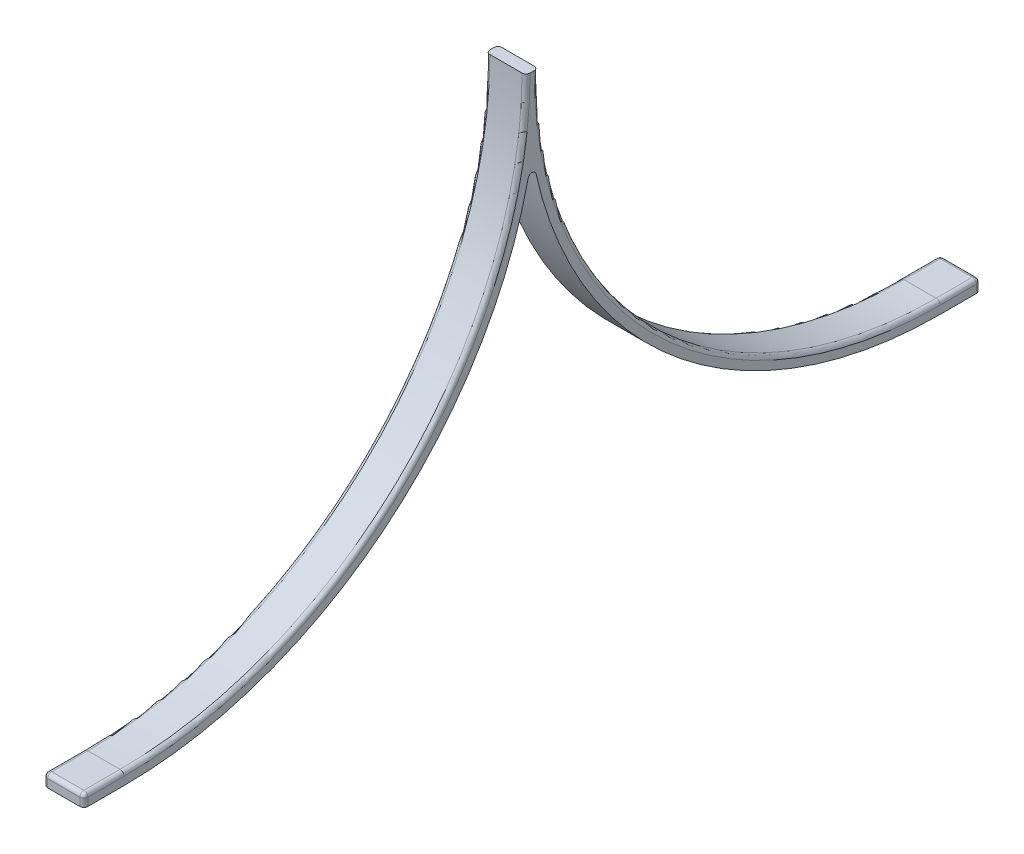
ISO-10303-21;
HEADER;
FILE_DESCRIPTION(('STEP AP214'),'2;1');
FILE_NAME('part.step','',(''),(''),'','','');
FILE_SCHEMA(('AUTOMOTIVE_DESIGN { 1 0 10303 214 1 1 1 1 }'));
ENDSEC;
DATA;
#1=APPLICATION_CONTEXT('core data for automotive mechanical design processes');
#2=APPLICATION_PROTOCOL_DEFINITION('international standard','automotive_design',2000,#1);
#3=PRODUCT_CONTEXT('',#1,'mechanical');
#4=PRODUCT('Part','Part','',(#3));
#5=PRODUCT_RELATED_PRODUCT_CATEGORY('part','',(#4));
#6=PRODUCT_DEFINITION_FORMATION('','',#4);
#7=PRODUCT_DEFINITION_CONTEXT('part definition',#1,'design');
#8=PRODUCT_DEFINITION('design','',#6,#7);
#9=PRODUCT_DEFINITION_SHAPE('','',#8);
#10=(LENGTH_UNIT() NAMED_UNIT(*) SI_UNIT(.MILLI.,.METRE.));
#11=(NAMED_UNIT(*) PLANE_ANGLE_UNIT() SI_UNIT($,.RADIAN.));
#12=(NAMED_UNIT(*) SI_UNIT($,.STERADIAN.) SOLID_ANGLE_UNIT());
#13=UNCERTAINTY_MEASURE_WITH_UNIT(LENGTH_MEASURE(1.E-05),#10,'distance_accuracy_value','');
#14=(GEOMETRIC_REPRESENTATION_CONTEXT(3) GLOBAL_UNCERTAINTY_ASSIGNED_CONTEXT((#13)) GLOBAL_UNIT_ASSIGNED_CONTEXT((#10,
#11,#12)) REPRESENTATION_CONTEXT('',''));
#15=CARTESIAN_POINT('',(0.,0.,0.));
#16=DIRECTION('',(0.,0.,1.));
#17=DIRECTION('',(1.,0.,0.));
#18=AXIS2_PLACEMENT_3D('',#15,#16,#17);
#19=CARTESIAN_POINT('',(75.,-318.5,62.9999999999999));
#20=DIRECTION('',(-1.,0.,0.));
#21=DIRECTION('',(0.,0.,1.));
#22=AXIS2_PLACEMENT_3D('',#19,#20,#21);
#23=CYLINDRICAL_SURFACE('',#22,100.);
#24=DIRECTION('',(-1.,0.,0.));
#25=VECTOR('',#24,1.);
#26=CARTESIAN_POINT('',(75.,-418.5,62.9999999999999));
#27=LINE('',#26,#25);
#28=CARTESIAN_POINT('',(74.,-418.5,62.9999999999999));
#29=VERTEX_POINT('',#28);
#30=CARTESIAN_POINT('',(66.,-418.5,62.9999999999999));
#31=VERTEX_POINT('',#30);
#32=EDGE_CURVE('E206',#29,#31,#27,.T.);
#33=ORIENTED_EDGE('',*,*,#32,.T.);
#34=CARTESIAN_POINT('',(66.,-318.5,62.9999999999999));
#35=DIRECTION('',(1.,0.,0.));
#36=DIRECTION('',(0.,1.,0.));
#37=AXIS2_PLACEMENT_3D('',#34,#35,#36);
#38=CIRCLE('',#37,100.);
#39=CARTESIAN_POINT('',(66.,-318.5,163.));
#40=VERTEX_POINT('',#39);
#41=EDGE_CURVE('E209',#31,#40,#38,.F.);
#42=ORIENTED_EDGE('',*,*,#41,.T.);
#43=DIRECTION('',(-1.,0.,0.));
#44=VECTOR('',#43,1.);
#45=CARTESIAN_POINT('',(75.,-318.5,163.));
#46=LINE('',#45,#44);
#47=CARTESIAN_POINT('',(74.,-318.5,163.));
#48=VERTEX_POINT('',#47);
#49=EDGE_CURVE('E199',#48,#40,#46,.T.);
#50=ORIENTED_EDGE('',*,*,#49,.F.);
#51=CARTESIAN_POINT('',(74.,-318.5,62.9999999999999));
#52=DIRECTION('',(-1.,0.,0.));
#53=DIRECTION('',(0.,0.,1.));
#54=AXIS2_PLACEMENT_3D('',#51,#52,#53);
#55=CIRCLE('',#54,100.);
#56=EDGE_CURVE('E291',#48,#29,#55,.F.);
#57=ORIENTED_EDGE('',*,*,#56,.T.);
#58=EDGE_LOOP('',(#33,#42,#50,#57));
#59=FACE_BOUND('',#58,.T.);
#60=ADVANCED_FACE('F64',(#59),#23,.F.);
#61=CARTESIAN_POINT('',(75.,-318.5,62.9999999999999));
#62=DIRECTION('',(-1.,0.,0.));
#63=DIRECTION('',(0.,0.,1.));
#64=AXIS2_PLACEMENT_3D('',#61,#62,#63);
#65=CYLINDRICAL_SURFACE('',#64,103.);
#66=CARTESIAN_POINT('',(75.,-318.5,62.9999999999999));
#67=DIRECTION('',(-1.,0.,0.));
#68=DIRECTION('',(0.,0.,-1.));
#69=AXIS2_PLACEMENT_3D('',#66,#67,#68);
#70=CIRCLE('',#69,103.);
#71=CARTESIAN_POINT('',(75.,-421.5,62.9999999999999));
#72=VERTEX_POINT('',#71);
#73=CARTESIAN_POINT('',(75.,-340.948111087197,163.524038461538));
#74=VERTEX_POINT('',#73);
#75=EDGE_CURVE('E290',#72,#74,#70,.T.);
#76=ORIENTED_EDGE('',*,*,#75,.T.);
#77=DIRECTION('',(-1.,0.,0.));
#78=VECTOR('',#77,1.);
#79=CARTESIAN_POINT('',(75.,-340.948111087197,163.524038461538));
#80=LINE('',#79,#78);
#81=CARTESIAN_POINT('',(65.,-340.948111087197,163.524038461538));
#82=VERTEX_POINT('',#81);
#83=EDGE_CURVE('E183',#74,#82,#80,.T.);
#84=ORIENTED_EDGE('',*,*,#83,.T.);
#85=CARTESIAN_POINT('',(65.,-318.5,62.9999999999999));
#86=DIRECTION('',(1.,0.,0.));
#87=DIRECTION('',(0.,1.,0.));
#88=AXIS2_PLACEMENT_3D('',#85,#86,#87);
#89=CIRCLE('',#88,103.);
#90=CARTESIAN_POINT('',(65.,-421.5,62.9999999999999));
#91=VERTEX_POINT('',#90);
#92=EDGE_CURVE('E167',#91,#82,#89,.F.);
#93=ORIENTED_EDGE('',*,*,#92,.F.);
#94=DIRECTION('',(-1.,0.,0.));
#95=VECTOR('',#94,1.);
#96=CARTESIAN_POINT('',(75.,-421.5,62.9999999999999));
#97=LINE('',#96,#95);
#98=EDGE_CURVE('E180',#72,#91,#97,.T.);
#99=ORIENTED_EDGE('',*,*,#98,.F.);
#100=EDGE_LOOP('',(#76,#84,#93,#99));
#101=FACE_BOUND('',#100,.T.);
#102=ADVANCED_FACE('F179',(#101),#65,.T.);
#103=CARTESIAN_POINT('',(75.,-421.5,52.9999999999999));
#104=DIRECTION('',(0.,-1.,0.));
#105=DIRECTION('',(0.,0.,-1.));
#106=AXIS2_PLACEMENT_3D('',#103,#104,#105);
#107=PLANE('',#106);
#108=DIRECTION('',(-1.,0.,0.));
#109=VECTOR('',#108,1.);
#110=CARTESIAN_POINT('',(75.,-421.5,52.9999999999999));
#111=LINE('',#110,#109);
#112=CARTESIAN_POINT('',(74.,-421.5,52.9999999999999));
#113=VERTEX_POINT('',#112);
#114=CARTESIAN_POINT('',(66.,-421.5,52.9999999999999));
#115=VERTEX_POINT('',#114);
#116=EDGE_CURVE('E201',#113,#115,#111,.T.);
#117=ORIENTED_EDGE('',*,*,#116,.F.);
#118=CARTESIAN_POINT('',(74.,-421.5,53.9999999999999));
#119=DIRECTION('',(0.,-1.,0.));
#120=DIRECTION('',(0.,0.,-1.));
#121=AXIS2_PLACEMENT_3D('',#118,#119,#120);
#122=CIRCLE('',#121,1.);
#123=CARTESIAN_POINT('',(75.,-421.5,53.9999999999999));
#124=VERTEX_POINT('',#123);
#125=EDGE_CURVE('E195',#113,#124,#122,.T.);
#126=ORIENTED_EDGE('',*,*,#125,.T.);
#127=DIRECTION('',(0.,0.,1.));
#128=VECTOR('',#127,1.);
#129=CARTESIAN_POINT('',(75.,-421.5,52.9999999999999));
#130=LINE('',#129,#128);
#131=EDGE_CURVE('E190',#124,#72,#130,.T.);
#132=ORIENTED_EDGE('',*,*,#131,.T.);
#133=ORIENTED_EDGE('',*,*,#98,.T.);
#134=DIRECTION('',(0.,0.,1.));
#135=VECTOR('',#134,1.);
#136=CARTESIAN_POINT('',(65.,-421.5,52.9999999999999));
#137=LINE('',#136,#135);
#138=CARTESIAN_POINT('',(65.,-421.5,53.9999999999999));
#139=VERTEX_POINT('',#138);
#140=EDGE_CURVE('E164',#139,#91,#137,.T.);
#141=ORIENTED_EDGE('',*,*,#140,.F.);
#142=CARTESIAN_POINT('',(66.,-421.5,53.9999999999999));
#143=DIRECTION('',(0.,-1.,0.));
#144=DIRECTION('',(0.,0.,-1.));
#145=AXIS2_PLACEMENT_3D('',#142,#143,#144);
#146=CIRCLE('',#145,1.);
#147=EDGE_CURVE('E191',#139,#115,#146,.T.);
#148=ORIENTED_EDGE('',*,*,#147,.T.);
#149=EDGE_LOOP('',(#117,#126,#132,#133,#141,#148));
#150=FACE_BOUND('',#149,.T.);
#151=ADVANCED_FACE('F187',(#150),#107,.T.);
#152=CARTESIAN_POINT('',(75.,-418.5,52.9999999999999));
#153=DIRECTION('',(0.,0.,-1.));
#154=DIRECTION('',(0.,1.,0.));
#155=AXIS2_PLACEMENT_3D('',#152,#153,#154);
#156=PLANE('',#155);
#157=DIRECTION('',(-1.,0.,0.));
#158=VECTOR('',#157,1.);
#159=CARTESIAN_POINT('',(75.,-419.5,52.9999999999999));
#160=LINE('',#159,#158);
#161=CARTESIAN_POINT('',(66.,-419.5,52.9999999999999));
#162=VERTEX_POINT('',#161);
#163=CARTESIAN_POINT('',(74.,-419.5,52.9999999999999));
#164=VERTEX_POINT('',#163);
#165=EDGE_CURVE('E193',#162,#164,#160,.F.);
#166=ORIENTED_EDGE('',*,*,#165,.T.);
#167=DIRECTION('',(0.,-1.,0.));
#168=VECTOR('',#167,1.);
#169=CARTESIAN_POINT('',(74.,-421.5,52.9999999999999));
#170=LINE('',#169,#168);
#171=EDGE_CURVE('E205',#164,#113,#170,.T.);
#172=ORIENTED_EDGE('',*,*,#171,.T.);
#173=ORIENTED_EDGE('',*,*,#116,.T.);
#174=DIRECTION('',(0.,-1.,0.));
#175=VECTOR('',#174,1.);
#176=CARTESIAN_POINT('',(66.,-418.5,52.9999999999999));
#177=LINE('',#176,#175);
#178=EDGE_CURVE('E204',#115,#162,#177,.F.);
#179=ORIENTED_EDGE('',*,*,#178,.T.);
#180=EDGE_LOOP('',(#166,#172,#173,#179));
#181=FACE_BOUND('',#180,.T.);
#182=ADVANCED_FACE('F416',(#181),#156,.T.);
#183=CARTESIAN_POINT('',(75.,-418.5,62.9999999999999));
#184=DIRECTION('',(0.,1.,0.));
#185=DIRECTION('',(0.,0.,1.));
#186=AXIS2_PLACEMENT_3D('',#183,#184,#185);
#187=PLANE('',#186);
#188=DIRECTION('',(-1.,0.,0.));
#189=VECTOR('',#188,1.);
#190=CARTESIAN_POINT('',(75.,-418.5,53.9999999999999));
#191=LINE('',#190,#189);
#192=CARTESIAN_POINT('',(74.,-418.5,53.9999999999999));
#193=VERTEX_POINT('',#192);
#194=CARTESIAN_POINT('',(66.,-418.5,53.9999999999999));
#195=VERTEX_POINT('',#194);
#196=EDGE_CURVE('E260',#193,#195,#191,.T.);
#197=ORIENTED_EDGE('',*,*,#196,.T.);
#198=DIRECTION('',(0.,0.,-1.));
#199=VECTOR('',#198,1.);
#200=CARTESIAN_POINT('',(66.,-418.5,62.9999999999999));
#201=LINE('',#200,#199);
#202=EDGE_CURVE('E256',#195,#31,#201,.F.);
#203=ORIENTED_EDGE('',*,*,#202,.T.);
#204=ORIENTED_EDGE('',*,*,#32,.F.);
#205=DIRECTION('',(0.,0.,-1.));
#206=VECTOR('',#205,1.);
#207=CARTESIAN_POINT('',(74.,-418.5,52.9999999999999));
#208=LINE('',#207,#206);
#209=EDGE_CURVE('E259',#29,#193,#208,.T.);
#210=ORIENTED_EDGE('',*,*,#209,.T.);
#211=EDGE_LOOP('',(#197,#203,#204,#210));
#212=FACE_BOUND('',#211,.T.);
#213=ADVANCED_FACE('F484',(#212),#187,.T.);
#214=CARTESIAN_POINT('',(75.,-318.5,266.));
#215=DIRECTION('',(-1.,0.,0.));
#216=DIRECTION('',(0.,0.,1.));
#217=AXIS2_PLACEMENT_3D('',#214,#215,#216);
#218=CYLINDRICAL_SURFACE('',#217,100.);
#219=DIRECTION('',(-1.,0.,0.));
#220=VECTOR('',#219,1.);
#221=CARTESIAN_POINT('',(75.,-318.5,166.));
#222=LINE('',#221,#220);
#223=CARTESIAN_POINT('',(74.,-318.5,166.));
#224=VERTEX_POINT('',#223);
#225=CARTESIAN_POINT('',(66.,-318.5,166.));
#226=VERTEX_POINT('',#225);
#227=EDGE_CURVE('E263',#224,#226,#222,.T.);
#228=ORIENTED_EDGE('',*,*,#227,.T.);
#229=CARTESIAN_POINT('',(66.,-318.5,266.));
#230=DIRECTION('',(1.,0.,0.));
#231=DIRECTION('',(0.,1.,0.));
#232=AXIS2_PLACEMENT_3D('',#229,#230,#231);
#233=CIRCLE('',#232,100.);
#234=CARTESIAN_POINT('',(66.,-418.5,266.));
#235=VERTEX_POINT('',#234);
#236=EDGE_CURVE('E266',#226,#235,#233,.F.);
#237=ORIENTED_EDGE('',*,*,#236,.T.);
#238=DIRECTION('',(-1.,0.,0.));
#239=VECTOR('',#238,1.);
#240=CARTESIAN_POINT('',(75.,-418.5,266.));
#241=LINE('',#240,#239);
#242=CARTESIAN_POINT('',(74.,-418.5,266.));
#243=VERTEX_POINT('',#242);
#244=EDGE_CURVE('E210',#243,#235,#241,.T.);
#245=ORIENTED_EDGE('',*,*,#244,.F.);
#246=CARTESIAN_POINT('',(74.,-318.5,266.));
#247=DIRECTION('',(-1.,0.,0.));
#248=DIRECTION('',(0.,0.,1.));
#249=AXIS2_PLACEMENT_3D('',#246,#247,#248);
#250=CIRCLE('',#249,100.);
#251=EDGE_CURVE('E213',#243,#224,#250,.F.);
#252=ORIENTED_EDGE('',*,*,#251,.T.);
#253=EDGE_LOOP('',(#228,#237,#245,#252));
#254=FACE_BOUND('',#253,.T.);
#255=ADVANCED_FACE('F304',(#254),#218,.F.);
#256=CARTESIAN_POINT('',(75.,-418.5,266.));
#257=DIRECTION('',(0.,-1.,0.));
#258=DIRECTION('',(0.,0.,-1.));
#259=AXIS2_PLACEMENT_3D('',#256,#257,#258);
#260=PLANE('',#259);
#261=ORIENTED_EDGE('',*,*,#244,.T.);
#262=DIRECTION('',(0.,0.,1.));
#263=VECTOR('',#262,1.);
#264=CARTESIAN_POINT('',(66.,-418.5,266.));
#265=LINE('',#264,#263);
#266=CARTESIAN_POINT('',(66.,-418.5,275.));
#267=VERTEX_POINT('',#266);
#268=EDGE_CURVE('E212',#235,#267,#265,.T.);
#269=ORIENTED_EDGE('',*,*,#268,.T.);
#270=DIRECTION('',(-1.,0.,0.));
#271=VECTOR('',#270,1.);
#272=CARTESIAN_POINT('',(75.,-418.5,275.));
#273=LINE('',#272,#271);
#274=CARTESIAN_POINT('',(74.,-418.5,275.));
#275=VERTEX_POINT('',#274);
#276=EDGE_CURVE('E281',#267,#275,#273,.F.);
#277=ORIENTED_EDGE('',*,*,#276,.T.);
#278=DIRECTION('',(0.,0.,1.));
#279=VECTOR('',#278,1.);
#280=CARTESIAN_POINT('',(74.,-418.5,266.));
#281=LINE('',#280,#279);
#282=EDGE_CURVE('E282',#275,#243,#281,.F.);
#283=ORIENTED_EDGE('',*,*,#282,.T.);
#284=EDGE_LOOP('',(#261,#269,#277,#283));
#285=FACE_BOUND('',#284,.T.);
#286=ADVANCED_FACE('F467',(#285),#260,.F.);
#287=CARTESIAN_POINT('',(75.,-418.5,276.));
#288=DIRECTION('',(0.,0.,-1.));
#289=DIRECTION('',(0.,1.,0.));
#290=AXIS2_PLACEMENT_3D('',#287,#288,#289);
#291=PLANE('',#290);
#292=DIRECTION('',(-1.,0.,0.));
#293=VECTOR('',#292,1.);
#294=CARTESIAN_POINT('',(75.,-421.5,276.));
#295=LINE('',#294,#293);
#296=CARTESIAN_POINT('',(74.,-421.5,276.));
#297=VERTEX_POINT('',#296);
#298=CARTESIAN_POINT('',(66.,-421.5,276.));
#299=VERTEX_POINT('',#298);
#300=EDGE_CURVE('E214',#297,#299,#295,.T.);
#301=ORIENTED_EDGE('',*,*,#300,.F.);
#302=DIRECTION('',(0.,-1.,0.));
#303=VECTOR('',#302,1.);
#304=CARTESIAN_POINT('',(74.,-418.5,276.));
#305=LINE('',#304,#303);
#306=CARTESIAN_POINT('',(74.,-419.5,276.));
#307=VERTEX_POINT('',#306);
#308=EDGE_CURVE('E284',#297,#307,#305,.F.);
#309=ORIENTED_EDGE('',*,*,#308,.T.);
#310=DIRECTION('',(-1.,0.,0.));
#311=VECTOR('',#310,1.);
#312=CARTESIAN_POINT('',(75.,-419.5,276.));
#313=LINE('',#312,#311);
#314=CARTESIAN_POINT('',(66.,-419.5,276.));
#315=VERTEX_POINT('',#314);
#316=EDGE_CURVE('E230',#307,#315,#313,.T.);
#317=ORIENTED_EDGE('',*,*,#316,.T.);
#318=DIRECTION('',(0.,1.,0.));
#319=VECTOR('',#318,1.);
#320=CARTESIAN_POINT('',(66.,-418.5,276.));
#321=LINE('',#320,#319);
#322=EDGE_CURVE('E225',#315,#299,#321,.F.);
#323=ORIENTED_EDGE('',*,*,#322,.T.);
#324=EDGE_LOOP('',(#301,#309,#317,#323));
#325=FACE_BOUND('',#324,.T.);
#326=ADVANCED_FACE('F350',(#325),#291,.F.);
#327=CARTESIAN_POINT('',(75.,-421.5,276.));
#328=DIRECTION('',(0.,1.,0.));
#329=DIRECTION('',(0.,0.,1.));
#330=AXIS2_PLACEMENT_3D('',#327,#328,#329);
#331=PLANE('',#330);
#332=DIRECTION('',(0.,0.,-1.));
#333=VECTOR('',#332,1.);
#334=CARTESIAN_POINT('',(75.,-421.5,276.));
#335=LINE('',#334,#333);
#336=CARTESIAN_POINT('',(75.,-421.5,275.));
#337=VERTEX_POINT('',#336);
#338=CARTESIAN_POINT('',(75.,-421.5,266.));
#339=VERTEX_POINT('',#338);
#340=EDGE_CURVE('E244',#337,#339,#335,.T.);
#341=ORIENTED_EDGE('',*,*,#340,.F.);
#342=CARTESIAN_POINT('',(74.,-421.5,275.));
#343=DIRECTION('',(0.,1.,0.));
#344=DIRECTION('',(0.,0.,1.));
#345=AXIS2_PLACEMENT_3D('',#342,#343,#344);
#346=CIRCLE('',#345,1.);
#347=EDGE_CURVE('E217',#337,#297,#346,.F.);
#348=ORIENTED_EDGE('',*,*,#347,.T.);
#349=ORIENTED_EDGE('',*,*,#300,.T.);
#350=CARTESIAN_POINT('',(66.,-421.5,275.));
#351=DIRECTION('',(0.,1.,0.));
#352=DIRECTION('',(0.,0.,1.));
#353=AXIS2_PLACEMENT_3D('',#350,#351,#352);
#354=CIRCLE('',#353,1.);
#355=CARTESIAN_POINT('',(65.,-421.5,275.));
#356=VERTEX_POINT('',#355);
#357=EDGE_CURVE('E216',#299,#356,#354,.F.);
#358=ORIENTED_EDGE('',*,*,#357,.T.);
#359=DIRECTION('',(0.,0.,-1.));
#360=VECTOR('',#359,1.);
#361=CARTESIAN_POINT('',(65.,-421.5,276.));
#362=LINE('',#361,#360);
#363=CARTESIAN_POINT('',(65.,-421.5,266.));
#364=VERTEX_POINT('',#363);
#365=EDGE_CURVE('E223',#356,#364,#362,.T.);
#366=ORIENTED_EDGE('',*,*,#365,.T.);
#367=DIRECTION('',(-1.,0.,0.));
#368=VECTOR('',#367,1.);
#369=CARTESIAN_POINT('',(75.,-421.5,266.));
#370=LINE('',#369,#368);
#371=EDGE_CURVE('E68',#339,#364,#370,.T.);
#372=ORIENTED_EDGE('',*,*,#371,.F.);
#373=EDGE_LOOP('',(#341,#348,#349,#358,#366,#372));
#374=FACE_BOUND('',#373,.T.);
#375=ADVANCED_FACE('F501',(#374),#331,.F.);
#376=CARTESIAN_POINT('',(75.,-318.5,266.));
#377=DIRECTION('',(-1.,0.,0.));
#378=DIRECTION('',(0.,0.,1.));
#379=AXIS2_PLACEMENT_3D('',#376,#377,#378);
#380=CYLINDRICAL_SURFACE('',#379,103.);
#381=CARTESIAN_POINT('',(65.,-318.5,266.));
#382=DIRECTION('',(1.,0.,0.));
#383=DIRECTION('',(0.,1.,0.));
#384=AXIS2_PLACEMENT_3D('',#381,#382,#383);
#385=CIRCLE('',#384,103.);
#386=CARTESIAN_POINT('',(65.,-340.948111087197,165.475961538461));
#387=VERTEX_POINT('',#386);
#388=EDGE_CURVE('E286',#364,#387,#385,.T.);
#389=ORIENTED_EDGE('',*,*,#388,.T.);
#390=DIRECTION('',(-1.,0.,0.));
#391=VECTOR('',#390,1.);
#392=CARTESIAN_POINT('',(75.,-340.948111087197,165.475961538461));
#393=LINE('',#392,#391);
#394=CARTESIAN_POINT('',(75.,-340.948111087197,165.475961538461));
#395=VERTEX_POINT('',#394);
#396=EDGE_CURVE('E289',#387,#395,#393,.F.);
#397=ORIENTED_EDGE('',*,*,#396,.T.);
#398=CARTESIAN_POINT('',(75.,-318.5,266.));
#399=DIRECTION('',(1.,0.,0.));
#400=DIRECTION('',(0.,0.,1.));
#401=AXIS2_PLACEMENT_3D('',#398,#399,#400);
#402=CIRCLE('',#401,103.);
#403=EDGE_CURVE('E294',#339,#395,#402,.T.);
#404=ORIENTED_EDGE('',*,*,#403,.F.);
#405=ORIENTED_EDGE('',*,*,#371,.T.);
#406=EDGE_LOOP('',(#389,#397,#404,#405));
#407=FACE_BOUND('',#406,.T.);
#408=ADVANCED_FACE('F498',(#407),#380,.T.);
#409=CARTESIAN_POINT('',(75.,0.,0.));
#410=DIRECTION('',(-1.,0.,0.));
#411=DIRECTION('',(0.,0.,1.));
#412=AXIS2_PLACEMENT_3D('',#409,#410,#411);
#413=PLANE('',#412);
#414=CARTESIAN_POINT('',(75.,-318.5,62.9999999999999));
#415=DIRECTION('',(-1.,0.,0.));
#416=DIRECTION('',(0.,0.,1.));
#417=AXIS2_PLACEMENT_3D('',#414,#415,#416);
#418=CIRCLE('',#417,101.);
#419=CARTESIAN_POINT('',(75.,-419.5,62.9999999999999));
#420=VERTEX_POINT('',#419);
#421=CARTESIAN_POINT('',(75.,-318.5,164.));
#422=VERTEX_POINT('',#421);
#423=EDGE_CURVE('E253',#420,#422,#418,.T.);
#424=ORIENTED_EDGE('',*,*,#423,.T.);
#425=DIRECTION('',(0.,0.,1.));
#426=VECTOR('',#425,1.);
#427=CARTESIAN_POINT('',(75.,-318.5,0.));
#428=LINE('',#427,#426);
#429=CARTESIAN_POINT('',(75.,-318.5,165.));
#430=VERTEX_POINT('',#429);
#431=EDGE_CURVE('E238',#422,#430,#428,.T.);
#432=ORIENTED_EDGE('',*,*,#431,.T.);
#433=CARTESIAN_POINT('',(75.,-318.5,266.));
#434=DIRECTION('',(-1.,0.,0.));
#435=DIRECTION('',(0.,0.,1.));
#436=AXIS2_PLACEMENT_3D('',#433,#434,#435);
#437=CIRCLE('',#436,101.);
#438=CARTESIAN_POINT('',(75.,-419.5,266.));
#439=VERTEX_POINT('',#438);
#440=EDGE_CURVE('E234',#430,#439,#437,.T.);
#441=ORIENTED_EDGE('',*,*,#440,.T.);
#442=DIRECTION('',(0.,0.,1.));
#443=VECTOR('',#442,1.);
#444=CARTESIAN_POINT('',(75.,-419.5,0.));
#445=LINE('',#444,#443);
#446=CARTESIAN_POINT('',(75.,-419.5,275.));
#447=VERTEX_POINT('',#446);
#448=EDGE_CURVE('E237',#439,#447,#445,.T.);
#449=ORIENTED_EDGE('',*,*,#448,.T.);
#450=DIRECTION('',(0.,-1.,0.));
#451=VECTOR('',#450,1.);
#452=CARTESIAN_POINT('',(75.,6.36065274524826E-13,274.999999999999));
#453=LINE('',#452,#451);
#454=EDGE_CURVE('E241',#447,#337,#453,.T.);
#455=ORIENTED_EDGE('',*,*,#454,.T.);
#456=ORIENTED_EDGE('',*,*,#340,.T.);
#457=ORIENTED_EDGE('',*,*,#403,.T.);
#458=CARTESIAN_POINT('',(75.,-341.166053913286,164.5));
#459=DIRECTION('',(-1.,0.,0.));
#460=DIRECTION('',(0.,0.,1.));
#461=AXIS2_PLACEMENT_3D('',#458,#459,#460);
#462=CIRCLE('',#461,1.);
#463=EDGE_CURVE('E249',#395,#74,#462,.T.);
#464=ORIENTED_EDGE('',*,*,#463,.T.);
#465=ORIENTED_EDGE('',*,*,#75,.F.);
#466=ORIENTED_EDGE('',*,*,#131,.F.);
#467=DIRECTION('',(0.,-1.,0.));
#468=VECTOR('',#467,1.);
#469=CARTESIAN_POINT('',(75.,-418.5,53.9999999999999));
#470=LINE('',#469,#468);
#471=CARTESIAN_POINT('',(75.,-419.5,53.9999999999999));
#472=VERTEX_POINT('',#471);
#473=EDGE_CURVE('E245',#124,#472,#470,.F.);
#474=ORIENTED_EDGE('',*,*,#473,.T.);
#475=DIRECTION('',(0.,0.,-1.));
#476=VECTOR('',#475,1.);
#477=CARTESIAN_POINT('',(75.,-419.5,62.9999999999999));
#478=LINE('',#477,#476);
#479=EDGE_CURVE('E248',#472,#420,#478,.F.);
#480=ORIENTED_EDGE('',*,*,#479,.T.);
#481=EDGE_LOOP('',(#424,#432,#441,#449,#455,#456,#457,#464,#465,#466,#474,#480));
#482=FACE_BOUND('',#481,.T.);
#483=ADVANCED_FACE('F489',(#482),#413,.F.);
#484=CARTESIAN_POINT('',(65.,-150.,-1.2E-05));
#485=DIRECTION('',(1.,0.,0.));
#486=DIRECTION('',(0.,1.,0.));
#487=AXIS2_PLACEMENT_3D('',#484,#485,#486);
#488=PLANE('',#487);
#489=CARTESIAN_POINT('',(65.,-318.5,266.));
#490=DIRECTION('',(1.,0.,0.));
#491=DIRECTION('',(0.,1.,0.));
#492=AXIS2_PLACEMENT_3D('',#489,#490,#491);
#493=CIRCLE('',#492,101.);
#494=CARTESIAN_POINT('',(65.,-419.5,266.));
#495=VERTEX_POINT('',#494);
#496=CARTESIAN_POINT('',(65.,-318.5,165.));
#497=VERTEX_POINT('',#496);
#498=EDGE_CURVE('E252',#495,#497,#493,.T.);
#499=ORIENTED_EDGE('',*,*,#498,.T.);
#500=DIRECTION('',(0.,0.,-1.));
#501=VECTOR('',#500,1.);
#502=CARTESIAN_POINT('',(65.,-318.5,-1.2E-05));
#503=LINE('',#502,#501);
#504=CARTESIAN_POINT('',(65.,-318.5,164.));
#505=VERTEX_POINT('',#504);
#506=EDGE_CURVE('E105',#497,#505,#503,.T.);
#507=ORIENTED_EDGE('',*,*,#506,.T.);
#508=CARTESIAN_POINT('',(65.,-318.5,62.9999999999999));
#509=DIRECTION('',(1.,0.,0.));
#510=DIRECTION('',(0.,1.,0.));
#511=AXIS2_PLACEMENT_3D('',#508,#509,#510);
#512=CIRCLE('',#511,101.);
#513=CARTESIAN_POINT('',(65.,-419.5,62.9999999999999));
#514=VERTEX_POINT('',#513);
#515=EDGE_CURVE('E278',#505,#514,#512,.T.);
#516=ORIENTED_EDGE('',*,*,#515,.T.);
#517=DIRECTION('',(0.,0.,-1.));
#518=VECTOR('',#517,1.);
#519=CARTESIAN_POINT('',(65.,-419.5,52.9999999999999));
#520=LINE('',#519,#518);
#521=CARTESIAN_POINT('',(65.,-419.5,53.9999999999999));
#522=VERTEX_POINT('',#521);
#523=EDGE_CURVE('E276',#514,#522,#520,.T.);
#524=ORIENTED_EDGE('',*,*,#523,.T.);
#525=DIRECTION('',(0.,-1.,0.));
#526=VECTOR('',#525,1.);
#527=CARTESIAN_POINT('',(65.,-421.5,53.9999999999999));
#528=LINE('',#527,#526);
#529=EDGE_CURVE('E169',#522,#139,#528,.T.);
#530=ORIENTED_EDGE('',*,*,#529,.T.);
#531=ORIENTED_EDGE('',*,*,#140,.T.);
#532=ORIENTED_EDGE('',*,*,#92,.T.);
#533=CARTESIAN_POINT('',(65.,-341.166053913286,164.5));
#534=DIRECTION('',(1.,0.,0.));
#535=DIRECTION('',(0.,1.,0.));
#536=AXIS2_PLACEMENT_3D('',#533,#534,#535);
#537=CIRCLE('',#536,1.);
#538=EDGE_CURVE('E184',#82,#387,#537,.T.);
#539=ORIENTED_EDGE('',*,*,#538,.T.);
#540=ORIENTED_EDGE('',*,*,#388,.F.);
#541=ORIENTED_EDGE('',*,*,#365,.F.);
#542=DIRECTION('',(0.,1.,0.));
#543=VECTOR('',#542,1.);
#544=CARTESIAN_POINT('',(65.,-149.999999999999,274.999999999999));
#545=LINE('',#544,#543);
#546=CARTESIAN_POINT('',(65.,-419.5,275.));
#547=VERTEX_POINT('',#546);
#548=EDGE_CURVE('E273',#356,#547,#545,.T.);
#549=ORIENTED_EDGE('',*,*,#548,.T.);
#550=DIRECTION('',(0.,0.,1.));
#551=VECTOR('',#550,1.);
#552=CARTESIAN_POINT('',(65.,-419.5,-1.2E-05));
#553=LINE('',#552,#551);
#554=EDGE_CURVE('E271',#547,#495,#553,.F.);
#555=ORIENTED_EDGE('',*,*,#554,.T.);
#556=EDGE_LOOP('',(#499,#507,#516,#524,#530,#531,#532,#539,#540,#541,#549,#555));
#557=FACE_BOUND('',#556,.T.);
#558=ADVANCED_FACE('F166',(#557),#488,.F.);
#559=CARTESIAN_POINT('',(74.,-318.5,62.9999999999999));
#560=DIRECTION('',(-1.,0.,0.));
#561=DIRECTION('',(0.,0.,1.));
#562=AXIS2_PLACEMENT_3D('',#559,#560,#561);
#563=TOROIDAL_SURFACE('',#562,101.,1.);
#564=CARTESIAN_POINT('',(74.,-318.5,164.));
#565=DIRECTION('',(0.,-1.,0.));
#566=DIRECTION('',(0.,0.,-1.));
#567=AXIS2_PLACEMENT_3D('',#564,#565,#566);
#568=CIRCLE('',#567,1.);
#569=EDGE_CURVE('E83',#48,#422,#568,.T.);
#570=ORIENTED_EDGE('',*,*,#569,.T.);
#571=ORIENTED_EDGE('',*,*,#423,.F.);
#572=CARTESIAN_POINT('',(74.,-419.5,62.9999999999999));
#573=DIRECTION('',(0.,0.,-1.));
#574=DIRECTION('',(-1.,0.,0.));
#575=AXIS2_PLACEMENT_3D('',#572,#573,#574);
#576=CIRCLE('',#575,1.);
#577=EDGE_CURVE('E472',#29,#420,#576,.T.);
#578=ORIENTED_EDGE('',*,*,#577,.F.);
#579=ORIENTED_EDGE('',*,*,#56,.F.);
#580=EDGE_LOOP('',(#570,#571,#578,#579));
#581=FACE_BOUND('',#580,.T.);
#582=ADVANCED_FACE('F480',(#581),#563,.T.);
#583=CARTESIAN_POINT('',(74.,-418.5,53.9999999999999));
#584=DIRECTION('',(0.,1.,0.));
#585=DIRECTION('',(0.,0.,1.));
#586=AXIS2_PLACEMENT_3D('',#583,#584,#585);
#587=CYLINDRICAL_SURFACE('',#586,1.);
#588=ORIENTED_EDGE('',*,*,#125,.F.);
#589=ORIENTED_EDGE('',*,*,#171,.F.);
#590=CARTESIAN_POINT('',(74.,-419.5,53.9999999999999));
#591=DIRECTION('',(0.,1.,0.));
#592=DIRECTION('',(0.,0.,1.));
#593=AXIS2_PLACEMENT_3D('',#590,#591,#592);
#594=CIRCLE('',#593,1.);
#595=EDGE_CURVE('E428',#472,#164,#594,.T.);
#596=ORIENTED_EDGE('',*,*,#595,.F.);
#597=ORIENTED_EDGE('',*,*,#473,.F.);
#598=EDGE_LOOP('',(#588,#589,#596,#597));
#599=FACE_BOUND('',#598,.T.);
#600=ADVANCED_FACE('F426',(#599),#587,.T.);
#601=CARTESIAN_POINT('',(74.,-419.5,62.9999999999999));
#602=DIRECTION('',(0.,0.,1.));
#603=DIRECTION('',(1.,0.,0.));
#604=AXIS2_PLACEMENT_3D('',#601,#602,#603);
#605=CYLINDRICAL_SURFACE('',#604,1.);
#606=ORIENTED_EDGE('',*,*,#577,.T.);
#607=ORIENTED_EDGE('',*,*,#479,.F.);
#608=CARTESIAN_POINT('',(74.,-419.5,53.9999999999999));
#609=DIRECTION('',(0.,0.,-1.));
#610=DIRECTION('',(-1.,0.,0.));
#611=AXIS2_PLACEMENT_3D('',#608,#609,#610);
#612=CIRCLE('',#611,1.);
#613=EDGE_CURVE('E436',#193,#472,#612,.T.);
#614=ORIENTED_EDGE('',*,*,#613,.F.);
#615=ORIENTED_EDGE('',*,*,#209,.F.);
#616=EDGE_LOOP('',(#606,#607,#614,#615));
#617=FACE_BOUND('',#616,.T.);
#618=ADVANCED_FACE('F487',(#617),#605,.T.);
#619=CARTESIAN_POINT('',(74.,-318.5,266.));
#620=DIRECTION('',(-1.,0.,0.));
#621=DIRECTION('',(0.,0.,1.));
#622=AXIS2_PLACEMENT_3D('',#619,#620,#621);
#623=TOROIDAL_SURFACE('',#622,101.,1.);
#624=CARTESIAN_POINT('',(74.,-318.5,165.));
#625=DIRECTION('',(0.,-1.,0.));
#626=DIRECTION('',(0.,0.,-1.));
#627=AXIS2_PLACEMENT_3D('',#624,#625,#626);
#628=CIRCLE('',#627,1.);
#629=EDGE_CURVE('E471',#430,#224,#628,.T.);
#630=ORIENTED_EDGE('',*,*,#629,.T.);
#631=ORIENTED_EDGE('',*,*,#251,.F.);
#632=CARTESIAN_POINT('',(74.,-419.5,266.));
#633=DIRECTION('',(0.,0.,1.));
#634=DIRECTION('',(1.,0.,0.));
#635=AXIS2_PLACEMENT_3D('',#632,#633,#634);
#636=CIRCLE('',#635,1.);
#637=EDGE_CURVE('E437',#439,#243,#636,.T.);
#638=ORIENTED_EDGE('',*,*,#637,.F.);
#639=ORIENTED_EDGE('',*,*,#440,.F.);
#640=EDGE_LOOP('',(#630,#631,#638,#639));
#641=FACE_BOUND('',#640,.T.);
#642=ADVANCED_FACE('F469',(#641),#623,.T.);
#643=CARTESIAN_POINT('',(74.,-419.5,53.9999999999999));
#644=DIRECTION('',(0.,0.,1.));
#645=DIRECTION('',(1.,0.,0.));
#646=AXIS2_PLACEMENT_3D('',#643,#644,#645);
#647=SPHERICAL_SURFACE('',#646,1.);
#648=ORIENTED_EDGE('',*,*,#613,.T.);
#649=ORIENTED_EDGE('',*,*,#595,.T.);
#650=CARTESIAN_POINT('',(74.,-419.5,53.9999999999999));
#651=DIRECTION('',(1.,0.,0.));
#652=DIRECTION('',(0.,0.,-1.));
#653=AXIS2_PLACEMENT_3D('',#650,#651,#652);
#654=CIRCLE('',#653,1.);
#655=EDGE_CURVE('E433',#193,#164,#654,.F.);
#656=ORIENTED_EDGE('',*,*,#655,.F.);
#657=EDGE_LOOP('',(#648,#649,#656));
#658=FACE_BOUND('',#657,.T.);
#659=ADVANCED_FACE('F432',(#658),#647,.T.);
#660=CARTESIAN_POINT('',(74.,-419.5,0.));
#661=DIRECTION('',(0.,0.,1.));
#662=DIRECTION('',(1.,0.,0.));
#663=AXIS2_PLACEMENT_3D('',#660,#661,#662);
#664=CYLINDRICAL_SURFACE('',#663,1.);
#665=ORIENTED_EDGE('',*,*,#637,.T.);
#666=ORIENTED_EDGE('',*,*,#282,.F.);
#667=CARTESIAN_POINT('',(74.,-419.5,275.));
#668=DIRECTION('',(0.,0.,1.));
#669=DIRECTION('',(0.,-1.,0.));
#670=AXIS2_PLACEMENT_3D('',#667,#668,#669);
#671=CIRCLE('',#670,1.);
#672=EDGE_CURVE('E443',#447,#275,#671,.T.);
#673=ORIENTED_EDGE('',*,*,#672,.F.);
#674=ORIENTED_EDGE('',*,*,#448,.F.);
#675=EDGE_LOOP('',(#665,#666,#673,#674));
#676=FACE_BOUND('',#675,.T.);
#677=ADVANCED_FACE('F464',(#676),#664,.T.);
#678=CARTESIAN_POINT('',(74.,6.36065274524826E-13,274.999999999999));
#679=DIRECTION('',(0.,-1.,0.));
#680=DIRECTION('',(0.,0.,-1.));
#681=AXIS2_PLACEMENT_3D('',#678,#679,#680);
#682=CYLINDRICAL_SURFACE('',#681,1.);
#683=ORIENTED_EDGE('',*,*,#347,.F.);
#684=ORIENTED_EDGE('',*,*,#454,.F.);
#685=CARTESIAN_POINT('',(74.,-419.5,275.));
#686=DIRECTION('',(0.,1.,0.));
#687=DIRECTION('',(0.,0.,1.));
#688=AXIS2_PLACEMENT_3D('',#685,#686,#687);
#689=CIRCLE('',#688,1.);
#690=EDGE_CURVE('E440',#307,#447,#689,.T.);
#691=ORIENTED_EDGE('',*,*,#690,.F.);
#692=ORIENTED_EDGE('',*,*,#308,.F.);
#693=EDGE_LOOP('',(#683,#684,#691,#692));
#694=FACE_BOUND('',#693,.T.);
#695=ADVANCED_FACE('F580',(#694),#682,.T.);
#696=CARTESIAN_POINT('',(66.,-150.,54.0000000000005));
#697=DIRECTION('',(0.,1.,0.));
#698=DIRECTION('',(0.,0.,1.));
#699=AXIS2_PLACEMENT_3D('',#696,#697,#698);
#700=CYLINDRICAL_SURFACE('',#699,1.);
#701=ORIENTED_EDGE('',*,*,#147,.F.);
#702=ORIENTED_EDGE('',*,*,#529,.F.);
#703=CARTESIAN_POINT('',(66.,-419.5,53.9999999999999));
#704=DIRECTION('',(0.,1.,0.));
#705=DIRECTION('',(0.,0.,1.));
#706=AXIS2_PLACEMENT_3D('',#703,#704,#705);
#707=CIRCLE('',#706,1.);
#708=EDGE_CURVE('E452',#162,#522,#707,.T.);
#709=ORIENTED_EDGE('',*,*,#708,.F.);
#710=ORIENTED_EDGE('',*,*,#178,.F.);
#711=EDGE_LOOP('',(#701,#702,#709,#710));
#712=FACE_BOUND('',#711,.T.);
#713=ADVANCED_FACE('F587',(#712),#700,.T.);
#714=CARTESIAN_POINT('',(75.,-419.5,53.9999999999999));
#715=DIRECTION('',(-1.,0.,0.));
#716=DIRECTION('',(0.,0.,1.));
#717=AXIS2_PLACEMENT_3D('',#714,#715,#716);
#718=CYLINDRICAL_SURFACE('',#717,1.);
#719=ORIENTED_EDGE('',*,*,#655,.T.);
#720=ORIENTED_EDGE('',*,*,#165,.F.);
#721=CARTESIAN_POINT('',(66.,-419.5,53.9999999999999));
#722=DIRECTION('',(-1.,0.,0.));
#723=DIRECTION('',(0.,0.,1.));
#724=AXIS2_PLACEMENT_3D('',#721,#722,#723);
#725=CIRCLE('',#724,1.);
#726=EDGE_CURVE('E450',#195,#162,#725,.T.);
#727=ORIENTED_EDGE('',*,*,#726,.F.);
#728=ORIENTED_EDGE('',*,*,#196,.F.);
#729=EDGE_LOOP('',(#719,#720,#727,#728));
#730=FACE_BOUND('',#729,.T.);
#731=ADVANCED_FACE('F439',(#730),#718,.T.);
#732=CARTESIAN_POINT('',(74.,-419.5,275.));
#733=DIRECTION('',(0.,0.,1.));
#734=DIRECTION('',(1.,0.,0.));
#735=AXIS2_PLACEMENT_3D('',#732,#733,#734);
#736=SPHERICAL_SURFACE('',#735,1.);
#737=ORIENTED_EDGE('',*,*,#690,.T.);
#738=ORIENTED_EDGE('',*,*,#672,.T.);
#739=CARTESIAN_POINT('',(74.,-419.5,275.));
#740=DIRECTION('',(1.,0.,0.));
#741=DIRECTION('',(0.,0.,-1.));
#742=AXIS2_PLACEMENT_3D('',#739,#740,#741);
#743=CIRCLE('',#742,1.);
#744=EDGE_CURVE('E372',#307,#275,#743,.F.);
#745=ORIENTED_EDGE('',*,*,#744,.F.);
#746=EDGE_LOOP('',(#737,#738,#745));
#747=FACE_BOUND('',#746,.T.);
#748=ADVANCED_FACE('F459',(#747),#736,.T.);
#749=CARTESIAN_POINT('',(66.,-419.5,53.9999999999999));
#750=DIRECTION('',(0.,0.,1.));
#751=DIRECTION('',(1.,0.,0.));
#752=AXIS2_PLACEMENT_3D('',#749,#750,#751);
#753=SPHERICAL_SURFACE('',#752,1.);
#754=ORIENTED_EDGE('',*,*,#726,.T.);
#755=ORIENTED_EDGE('',*,*,#708,.T.);
#756=CARTESIAN_POINT('',(66.,-419.5,53.9999999999999));
#757=DIRECTION('',(0.,0.,-1.));
#758=DIRECTION('',(-1.,0.,0.));
#759=AXIS2_PLACEMENT_3D('',#756,#757,#758);
#760=CIRCLE('',#759,1.);
#761=EDGE_CURVE('E369',#195,#522,#760,.F.);
#762=ORIENTED_EDGE('',*,*,#761,.F.);
#763=EDGE_LOOP('',(#754,#755,#762));
#764=FACE_BOUND('',#763,.T.);
#765=ADVANCED_FACE('F608',(#764),#753,.T.);
#766=CARTESIAN_POINT('',(75.,-419.5,275.));
#767=DIRECTION('',(-1.,0.,0.));
#768=DIRECTION('',(0.,0.,1.));
#769=AXIS2_PLACEMENT_3D('',#766,#767,#768);
#770=CYLINDRICAL_SURFACE('',#769,1.);
#771=ORIENTED_EDGE('',*,*,#744,.T.);
#772=ORIENTED_EDGE('',*,*,#276,.F.);
#773=CARTESIAN_POINT('',(66.,-419.5,275.));
#774=DIRECTION('',(-1.,0.,0.));
#775=DIRECTION('',(0.,0.,1.));
#776=AXIS2_PLACEMENT_3D('',#773,#774,#775);
#777=CIRCLE('',#776,1.);
#778=EDGE_CURVE('E364',#315,#267,#777,.T.);
#779=ORIENTED_EDGE('',*,*,#778,.F.);
#780=ORIENTED_EDGE('',*,*,#316,.F.);
#781=EDGE_LOOP('',(#771,#772,#779,#780));
#782=FACE_BOUND('',#781,.T.);
#783=ADVANCED_FACE('F365',(#782),#770,.T.);
#784=CARTESIAN_POINT('',(66.,-149.999999999999,274.999999999999));
#785=DIRECTION('',(0.,1.,0.));
#786=DIRECTION('',(0.,0.,1.));
#787=AXIS2_PLACEMENT_3D('',#784,#785,#786);
#788=CYLINDRICAL_SURFACE('',#787,1.);
#789=ORIENTED_EDGE('',*,*,#357,.F.);
#790=ORIENTED_EDGE('',*,*,#322,.F.);
#791=CARTESIAN_POINT('',(66.,-419.5,275.));
#792=DIRECTION('',(0.,1.,0.));
#793=DIRECTION('',(0.,0.,1.));
#794=AXIS2_PLACEMENT_3D('',#791,#792,#793);
#795=CIRCLE('',#794,1.);
#796=EDGE_CURVE('E360',#547,#315,#795,.T.);
#797=ORIENTED_EDGE('',*,*,#796,.F.);
#798=ORIENTED_EDGE('',*,*,#548,.F.);
#799=EDGE_LOOP('',(#789,#790,#797,#798));
#800=FACE_BOUND('',#799,.T.);
#801=ADVANCED_FACE('F357',(#800),#788,.T.);
#802=CARTESIAN_POINT('',(66.,-419.5,-1.2E-05));
#803=DIRECTION('',(0.,0.,1.));
#804=DIRECTION('',(1.,0.,0.));
#805=AXIS2_PLACEMENT_3D('',#802,#803,#804);
#806=CYLINDRICAL_SURFACE('',#805,1.);
#807=ORIENTED_EDGE('',*,*,#761,.T.);
#808=ORIENTED_EDGE('',*,*,#523,.F.);
#809=CARTESIAN_POINT('',(66.,-419.5,62.9999999999999));
#810=DIRECTION('',(0.,0.,1.));
#811=DIRECTION('',(1.,0.,0.));
#812=AXIS2_PLACEMENT_3D('',#809,#810,#811);
#813=CIRCLE('',#812,1.);
#814=EDGE_CURVE('E321',#31,#514,#813,.T.);
#815=ORIENTED_EDGE('',*,*,#814,.F.);
#816=ORIENTED_EDGE('',*,*,#202,.F.);
#817=EDGE_LOOP('',(#807,#808,#815,#816));
#818=FACE_BOUND('',#817,.T.);
#819=ADVANCED_FACE('F385',(#818),#806,.T.);
#820=CARTESIAN_POINT('',(66.,-419.5,275.));
#821=DIRECTION('',(0.,0.,1.));
#822=DIRECTION('',(1.,0.,0.));
#823=AXIS2_PLACEMENT_3D('',#820,#821,#822);
#824=SPHERICAL_SURFACE('',#823,1.);
#825=ORIENTED_EDGE('',*,*,#796,.T.);
#826=ORIENTED_EDGE('',*,*,#778,.T.);
#827=CARTESIAN_POINT('',(66.,-419.5,275.));
#828=DIRECTION('',(0.,0.,1.));
#829=DIRECTION('',(1.,0.,0.));
#830=AXIS2_PLACEMENT_3D('',#827,#828,#829);
#831=CIRCLE('',#830,1.);
#832=EDGE_CURVE('E318',#547,#267,#831,.F.);
#833=ORIENTED_EDGE('',*,*,#832,.F.);
#834=EDGE_LOOP('',(#825,#826,#833));
#835=FACE_BOUND('',#834,.T.);
#836=ADVANCED_FACE('F368',(#835),#824,.T.);
#837=CARTESIAN_POINT('',(66.,-318.5,62.9999999999999));
#838=DIRECTION('',(1.,0.,0.));
#839=DIRECTION('',(0.,1.,0.));
#840=AXIS2_PLACEMENT_3D('',#837,#838,#839);
#841=TOROIDAL_SURFACE('',#840,101.,1.);
#842=ORIENTED_EDGE('',*,*,#814,.T.);
#843=ORIENTED_EDGE('',*,*,#515,.F.);
#844=CARTESIAN_POINT('',(66.,-318.5,164.));
#845=DIRECTION('',(0.,1.,0.));
#846=DIRECTION('',(0.,0.,1.));
#847=AXIS2_PLACEMENT_3D('',#844,#845,#846);
#848=CIRCLE('',#847,1.);
#849=EDGE_CURVE('E74',#40,#505,#848,.T.);
#850=ORIENTED_EDGE('',*,*,#849,.F.);
#851=ORIENTED_EDGE('',*,*,#41,.F.);
#852=EDGE_LOOP('',(#842,#843,#850,#851));
#853=FACE_BOUND('',#852,.T.);
#854=ADVANCED_FACE('F380',(#853),#841,.T.);
#855=CARTESIAN_POINT('',(66.,-419.5,266.));
#856=DIRECTION('',(0.,0.,1.));
#857=DIRECTION('',(1.,0.,0.));
#858=AXIS2_PLACEMENT_3D('',#855,#856,#857);
#859=CYLINDRICAL_SURFACE('',#858,1.);
#860=ORIENTED_EDGE('',*,*,#832,.T.);
#861=ORIENTED_EDGE('',*,*,#268,.F.);
#862=CARTESIAN_POINT('',(66.,-419.5,266.));
#863=DIRECTION('',(0.,0.,-1.));
#864=DIRECTION('',(-1.,0.,0.));
#865=AXIS2_PLACEMENT_3D('',#862,#863,#864);
#866=CIRCLE('',#865,1.);
#867=EDGE_CURVE('E314',#495,#235,#866,.T.);
#868=ORIENTED_EDGE('',*,*,#867,.F.);
#869=ORIENTED_EDGE('',*,*,#554,.F.);
#870=EDGE_LOOP('',(#860,#861,#868,#869));
#871=FACE_BOUND('',#870,.T.);
#872=ADVANCED_FACE('F502',(#871),#859,.T.);
#873=CARTESIAN_POINT('',(66.,-318.5,266.));
#874=DIRECTION('',(1.,0.,0.));
#875=DIRECTION('',(0.,1.,0.));
#876=AXIS2_PLACEMENT_3D('',#873,#874,#875);
#877=TOROIDAL_SURFACE('',#876,101.,1.);
#878=ORIENTED_EDGE('',*,*,#867,.T.);
#879=ORIENTED_EDGE('',*,*,#236,.F.);
#880=CARTESIAN_POINT('',(66.,-318.5,165.));
#881=DIRECTION('',(0.,1.,0.));
#882=DIRECTION('',(0.,0.,1.));
#883=AXIS2_PLACEMENT_3D('',#880,#881,#882);
#884=CIRCLE('',#883,1.);
#885=EDGE_CURVE('E13',#497,#226,#884,.T.);
#886=ORIENTED_EDGE('',*,*,#885,.F.);
#887=ORIENTED_EDGE('',*,*,#498,.F.);
#888=EDGE_LOOP('',(#878,#879,#886,#887));
#889=FACE_BOUND('',#888,.T.);
#890=ADVANCED_FACE('F311',(#889),#877,.T.);
#891=CARTESIAN_POINT('',(75.,-341.166053913286,164.5));
#892=DIRECTION('',(1.,0.,0.));
#893=DIRECTION('',(0.,0.,-1.));
#894=AXIS2_PLACEMENT_3D('',#891,#892,#893);
#895=CYLINDRICAL_SURFACE('',#894,1.);
#896=ORIENTED_EDGE('',*,*,#463,.F.);
#897=ORIENTED_EDGE('',*,*,#396,.F.);
#898=ORIENTED_EDGE('',*,*,#538,.F.);
#899=ORIENTED_EDGE('',*,*,#83,.F.);
#900=EDGE_LOOP('',(#896,#897,#898,#899));
#901=FACE_BOUND('',#900,.T.);
#902=ADVANCED_FACE('F492',(#901),#895,.F.);
#903=CARTESIAN_POINT('',(78.2659982081033,-318.5,-292.247568964683));
#904=DIRECTION('',(0.,-1.,0.));
#905=DIRECTION('',(0.,0.,-1.));
#906=AXIS2_PLACEMENT_3D('',#903,#904,#905);
#907=PLANE('',#906);
#908=ORIENTED_EDGE('',*,*,#49,.T.);
#909=ORIENTED_EDGE('',*,*,#849,.T.);
#910=ORIENTED_EDGE('',*,*,#506,.F.);
#911=ORIENTED_EDGE('',*,*,#885,.T.);
#912=ORIENTED_EDGE('',*,*,#227,.F.);
#913=ORIENTED_EDGE('',*,*,#629,.F.);
#914=ORIENTED_EDGE('',*,*,#431,.F.);
#915=ORIENTED_EDGE('',*,*,#569,.F.);
#916=EDGE_LOOP('',(#908,#909,#910,#911,#912,#913,#914,#915));
#917=FACE_BOUND('',#916,.T.);
#918=ADVANCED_FACE('F66',(#917),#907,.F.);
#919=CLOSED_SHELL('',(#60,#102,#151,#182,#213,#255,#286,#326,#375,#408,#483,#558,#582,#600,#618,
#642,#659,#677,#695,#713,#731,#748,#765,#783,#801,#819,#836,#854,#872,#890,#902,#918));
#920=MANIFOLD_SOLID_BREP('B2',#919);
#921=ADVANCED_BREP_SHAPE_REPRESENTATION('',(#18,#920),#14);
#922=SHAPE_DEFINITION_REPRESENTATION(#9,#921);
ENDSEC;
END-ISO-10303-21;
